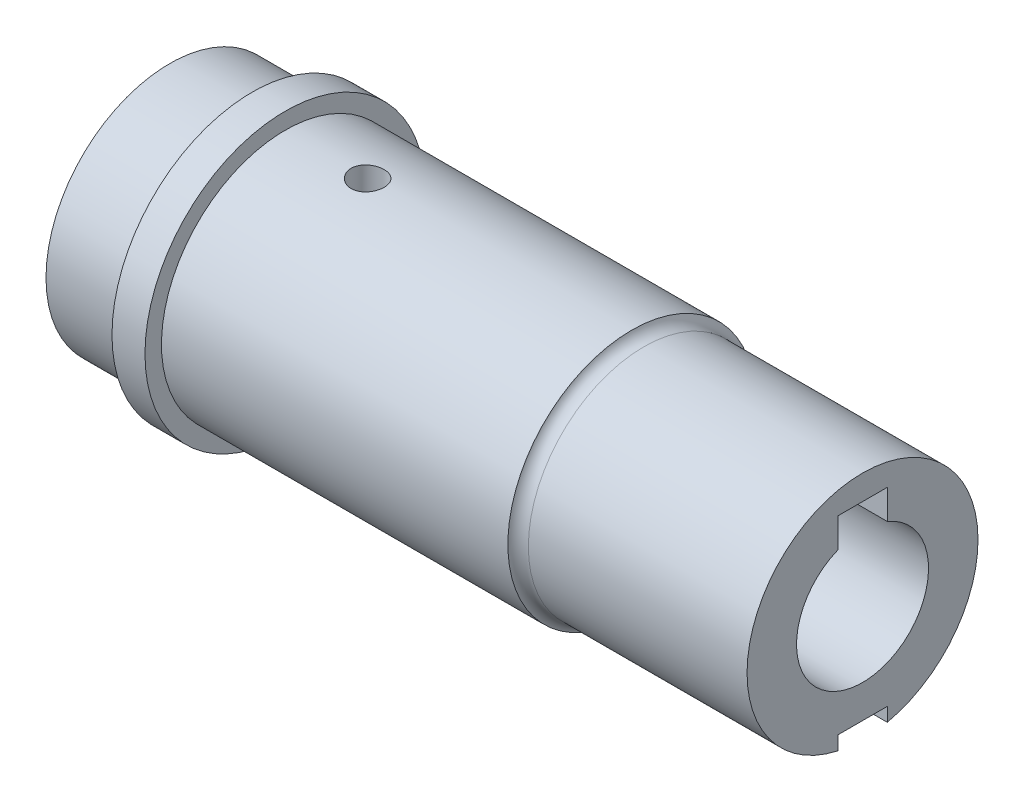
ISO-10303-21;
HEADER;
FILE_DESCRIPTION(('STEP AP214'),'2;1');
FILE_NAME('part.step','',(''),(''),'','','');
FILE_SCHEMA(('AUTOMOTIVE_DESIGN { 1 0 10303 214 1 1 1 1 }'));
ENDSEC;
DATA;
#1=APPLICATION_CONTEXT('core data for automotive mechanical design processes');
#2=APPLICATION_PROTOCOL_DEFINITION('international standard','automotive_design',2000,#1);
#3=PRODUCT_CONTEXT('',#1,'mechanical');
#4=PRODUCT('Part','Part','',(#3));
#5=PRODUCT_RELATED_PRODUCT_CATEGORY('part','',(#4));
#6=PRODUCT_DEFINITION_FORMATION('','',#4);
#7=PRODUCT_DEFINITION_CONTEXT('part definition',#1,'design');
#8=PRODUCT_DEFINITION('design','',#6,#7);
#9=PRODUCT_DEFINITION_SHAPE('','',#8);
#10=(LENGTH_UNIT() NAMED_UNIT(*) SI_UNIT(.MILLI.,.METRE.));
#11=(NAMED_UNIT(*) PLANE_ANGLE_UNIT() SI_UNIT($,.RADIAN.));
#12=(NAMED_UNIT(*) SI_UNIT($,.STERADIAN.) SOLID_ANGLE_UNIT());
#13=UNCERTAINTY_MEASURE_WITH_UNIT(LENGTH_MEASURE(1.E-05),#10,'distance_accuracy_value','');
#14=(GEOMETRIC_REPRESENTATION_CONTEXT(3) GLOBAL_UNCERTAINTY_ASSIGNED_CONTEXT((#13)) GLOBAL_UNIT_ASSIGNED_CONTEXT((#10,
#11,#12)) REPRESENTATION_CONTEXT('',''));
#15=CARTESIAN_POINT('',(0.,0.,0.));
#16=DIRECTION('',(0.,0.,1.));
#17=DIRECTION('',(1.,0.,0.));
#18=AXIS2_PLACEMENT_3D('',#15,#16,#17);
#19=CARTESIAN_POINT('',(42.,0.,0.));
#20=DIRECTION('',(-1.,0.,0.));
#21=DIRECTION('',(0.,0.,1.));
#22=AXIS2_PLACEMENT_3D('',#19,#20,#21);
#23=CYLINDRICAL_SURFACE('',#22,7.5);
#24=CARTESIAN_POINT('',(7.,0.,0.));
#25=DIRECTION('',(1.,0.,0.));
#26=DIRECTION('',(0.,0.,-1.));
#27=AXIS2_PLACEMENT_3D('',#24,#25,#26);
#28=CIRCLE('',#27,7.5);
#29=CARTESIAN_POINT('',(7.,0.,-7.5));
#30=VERTEX_POINT('',#29);
#31=EDGE_CURVE('E267',#30,#30,#28,.T.);
#32=ORIENTED_EDGE('',*,*,#31,.T.);
#33=EDGE_LOOP('',(#32));
#34=FACE_BOUND('',#33,.T.);
#35=CARTESIAN_POINT('',(12.,7.43303437365925,1.));
#36=CARTESIAN_POINT('',(12.0559019277301,7.43303522266631,0.99999764297421));
#37=CARTESIAN_POINT('',(12.1118380165464,7.43367182371829,0.995296633522847));
#38=CARTESIAN_POINT('',(12.222151231157,7.43614824351763,0.976618981332773));
#39=CARTESIAN_POINT('',(12.2765267024564,7.43798929330704,0.962632848245785));
#40=CARTESIAN_POINT('',(12.382105684117,7.44266246058434,0.925806555700512));
#41=CARTESIAN_POINT('',(12.4333114058099,7.4454938777722,0.902972651375005));
#42=CARTESIAN_POINT('',(12.5311555378537,7.45182791129731,0.849112824403647));
#43=CARTESIAN_POINT('',(12.5777946794687,7.45533041990363,0.818088216317403));
#44=CARTESIAN_POINT('',(12.6654867273345,7.46263688659337,0.74851685244753));
#45=CARTESIAN_POINT('',(12.7065064328398,7.4664424424659,0.709928411374281));
#46=CARTESIAN_POINT('',(12.7815081227281,7.47391188129393,0.626414614363067));
#47=CARTESIAN_POINT('',(12.8154897457381,7.47757575696696,0.581488933235995));
#48=CARTESIAN_POINT('',(12.8755709208582,7.48436549880109,0.486365862463802));
#49=CARTESIAN_POINT('',(12.9016402446451,7.48748928251119,0.43614921885561));
#50=CARTESIAN_POINT('',(12.9449630820904,7.49282926707925,0.332001908018684));
#51=CARTESIAN_POINT('',(12.9622169661888,7.49504550607303,0.2780713969612));
#52=CARTESIAN_POINT('',(12.9873194547901,7.49830943097799,0.168367687507043));
#53=CARTESIAN_POINT('',(12.995223407506,7.49936399102537,0.112607361734948));
#54=CARTESIAN_POINT('',(13.0015733043684,7.5002092398576,0.000542501151827599));
#55=CARTESIAN_POINT('',(13.0000196688683,7.49999998481415,-0.0557620093612336));
#56=CARTESIAN_POINT('',(12.9875426347295,7.49834672058453,-0.166940062232885));
#57=CARTESIAN_POINT('',(12.9766787676272,7.49691055668904,-0.221820418680892));
#58=CARTESIAN_POINT('',(12.9459828364892,7.49297362046144,-0.328972061356277));
#59=CARTESIAN_POINT('',(12.9261505824159,7.49047282557017,-0.38124329227092));
#60=CARTESIAN_POINT('',(12.8780182794391,7.48467409502082,-0.481875904212065));
#61=CARTESIAN_POINT('',(12.8496926884085,7.48137376072939,-0.53022492467663));
#62=CARTESIAN_POINT('',(12.7853963713586,7.4743447520952,-0.621505845367393));
#63=CARTESIAN_POINT('',(12.7494252466861,7.47061605542144,-0.664437462933408));
#64=CARTESIAN_POINT('',(12.6705260758205,7.46311294047831,-0.744015030772694));
#65=CARTESIAN_POINT('',(12.6275461159032,7.459338392122,-0.780609516765106));
#66=CARTESIAN_POINT('',(12.5360270343137,7.45219749384619,-0.846073465285956));
#67=CARTESIAN_POINT('',(12.4874878905985,7.44883114554537,-0.874942897181765));
#68=CARTESIAN_POINT('',(12.3861799998266,7.4428878816717,-0.9241414304325));
#69=CARTESIAN_POINT('',(12.3334090477408,7.44031138107393,-0.944466044533533));
#70=CARTESIAN_POINT('',(12.2251609896808,7.43624737732859,-0.97595045022462));
#71=CARTESIAN_POINT('',(12.1696840329867,7.43475981418081,-0.987110746770717));
#72=CARTESIAN_POINT('',(12.0580543324975,7.43305322505173,-0.999880803843635));
#73=CARTESIAN_POINT('',(12.0019100348337,7.43282455755814,-1.00156315549406));
#74=CARTESIAN_POINT('',(11.8901403719476,7.43363612148349,-0.995521440943979));
#75=CARTESIAN_POINT('',(11.8345149941303,7.43467632202375,-0.987797603648882));
#76=CARTESIAN_POINT('',(11.7255820067972,7.43789960218385,-0.963224025185097));
#77=CARTESIAN_POINT('',(11.6722662534909,7.44007823893825,-0.946409751616798));
#78=CARTESIAN_POINT('',(11.5692105432738,7.44532929507204,-0.904169225400625));
#79=CARTESIAN_POINT('',(11.5194707283381,7.44840174991421,-0.878742631046914));
#80=CARTESIAN_POINT('',(11.4246513447796,7.45511723309759,-0.819822032086053));
#81=CARTESIAN_POINT('',(11.3796014758159,7.45876356894567,-0.7862806158315));
#82=CARTESIAN_POINT('',(11.2957445307815,7.46620571758255,-0.712149161563993));
#83=CARTESIAN_POINT('',(11.256937731926,7.47000153699967,-0.671558810718769));
#84=CARTESIAN_POINT('',(11.1864117230394,7.47734474327666,-0.584163774179119));
#85=CARTESIAN_POINT('',(11.1547403418142,7.48089035024858,-0.537320320466262));
#86=CARTESIAN_POINT('',(11.0997158589123,7.48730670739152,-0.43893622615881));
#87=CARTESIAN_POINT('',(11.0763625701219,7.49017747274246,-0.38739569125685));
#88=CARTESIAN_POINT('',(11.0387153692059,7.49491282345577,-0.281236386261717));
#89=CARTESIAN_POINT('',(11.0243942854582,7.49678042410392,-0.226627392123681));
#90=CARTESIAN_POINT('',(11.0051297572695,7.49931158343309,-0.115753246711599));
#91=CARTESIAN_POINT('',(11.0001858286461,7.49997520428063,-0.0594881810999117));
#92=CARTESIAN_POINT('',(10.9998258663798,7.50002323624209,0.0526349368557948));
#93=CARTESIAN_POINT('',(11.0043362647028,7.49941752456714,0.108492762960941));
#94=CARTESIAN_POINT('',(11.022600520616,7.4970146660993,0.218648721526177));
#95=CARTESIAN_POINT('',(11.0363543652607,7.49521752097504,0.272946856170524));
#96=CARTESIAN_POINT('',(11.0726910235383,7.49063278321235,0.37842911729443));
#97=CARTESIAN_POINT('',(11.095269813204,7.48784564204157,0.429614650771956));
#98=CARTESIAN_POINT('',(11.1486077748229,7.48158874697992,0.527482039315438));
#99=CARTESIAN_POINT('',(11.1793670978262,7.47811898048495,0.574163811199582));
#100=CARTESIAN_POINT('',(11.2484633410018,7.47085145604927,0.662073643033369));
#101=CARTESIAN_POINT('',(11.2868548950696,7.46705145149955,0.703258578582));
#102=CARTESIAN_POINT('',(11.3700115345237,7.45956932448384,0.778629477936081));
#103=CARTESIAN_POINT('',(11.4147781219606,7.45588723005032,0.812813787651156));
#104=CARTESIAN_POINT('',(11.5096419707854,7.4490405494253,0.873343954892478));
#105=CARTESIAN_POINT('',(11.559761795755,7.44587830880396,0.89965470214564));
#106=CARTESIAN_POINT('',(11.6637242337586,7.4404568329187,0.943447591407442));
#107=CARTESIAN_POINT('',(11.7175627848798,7.43819663011144,0.960939198331794));
#108=CARTESIAN_POINT('',(11.8097241393627,7.43537566912471,0.982477401892938));
#109=CARTESIAN_POINT('',(11.8474691364837,7.4345021431111,0.989038740679089));
#110=CARTESIAN_POINT('',(11.9234707547356,7.43333120737231,0.997800826715829));
#111=CARTESIAN_POINT('',(11.9617273711999,7.43303379239608,1.00000161371131));
#112=CARTESIAN_POINT('',(12.,7.43303437365925,1.));
#113=B_SPLINE_CURVE_WITH_KNOTS('',3,(#35,#36,#37,#38,#39,#40,#41,#42,#43,#44,#45,#46,#47,#48,
#49,#50,#51,#52,#53,#54,#55,#56,#57,#58,#59,#60,#61,#62,#63,#64,#65,#66,#67,#68,#69,#70,#71,#72,
#73,#74,#75,#76,#77,#78,#79,#80,#81,#82,#83,#84,#85,#86,#87,#88,#89,#90,#91,#92,#93,#94,#95,#96,
#97,#98,#99,#100,#101,#102,#103,#104,#105,#106,#107,#108,#109,#110,#111,#112),.UNSPECIFIED.,.T.,
.F.,(4,2,2,2,2,2,2,2,2,2,2,2,2,2,2,2,2,2,2,2,2,2,2,2,2,2,2,2,2,2,2,2,2,2,2,2,2,2,4),(0.,
0.16756594461955,0.335303423041822,0.502922531373104,0.67051475416376,0.839057975594805,
1.00760984880017,1.17679778261471,1.34597860627362,1.51415284761382,1.68231961431326,
1.84941904333874,2.01652201332237,2.18413264227024,2.35175201291212,2.52067457533377,
2.68959780758443,2.85860963826768,3.02761215573449,3.19531851289863,3.36302078890669,
3.53007342408195,3.69713268808003,3.86519264070064,4.03326005374208,4.2024225588115,
4.37158125836474,4.54022861884065,4.70886727109971,4.87619854927048,5.04352959309218,
5.21078442673995,5.37804234889437,5.54654371183369,5.71508484203598,5.88436670989948,
6.05346651155517,6.16818970471025,6.28291185219902),.UNSPECIFIED.);
#114=CARTESIAN_POINT('',(12.,7.43303437365925,1.));
#115=VERTEX_POINT('',#114);
#116=EDGE_CURVE('E204',#115,#115,#113,.T.);
#117=ORIENTED_EDGE('',*,*,#116,.F.);
#118=EDGE_LOOP('',(#117));
#119=FACE_BOUND('',#118,.T.);
#120=CARTESIAN_POINT('',(28.,0.,0.));
#121=DIRECTION('',(1.,0.,0.));
#122=DIRECTION('',(0.,0.,-1.));
#123=AXIS2_PLACEMENT_3D('',#120,#121,#122);
#124=CIRCLE('',#123,7.5);
#125=CARTESIAN_POINT('',(28.,-7.34846922834954,-1.5));
#126=VERTEX_POINT('',#125);
#127=CARTESIAN_POINT('',(28.,-7.34846922834954,1.5));
#128=VERTEX_POINT('',#127);
#129=EDGE_CURVE('E164',#126,#128,#124,.T.);
#130=ORIENTED_EDGE('',*,*,#129,.F.);
#131=DIRECTION('',(-1.,0.,0.));
#132=VECTOR('',#131,1.);
#133=CARTESIAN_POINT('',(42.,-7.34846922834953,-1.5));
#134=LINE('',#133,#132);
#135=CARTESIAN_POINT('',(9.,-7.34846922834953,-1.5));
#136=VERTEX_POINT('',#135);
#137=EDGE_CURVE('E201',#126,#136,#134,.T.);
#138=ORIENTED_EDGE('',*,*,#137,.T.);
#139=CARTESIAN_POINT('',(9.,0.,0.));
#140=DIRECTION('',(-1.,0.,0.));
#141=DIRECTION('',(0.,0.,1.));
#142=AXIS2_PLACEMENT_3D('',#139,#140,#141);
#143=CIRCLE('',#142,7.5);
#144=CARTESIAN_POINT('',(9.,-7.34846922834953,1.5));
#145=VERTEX_POINT('',#144);
#146=EDGE_CURVE('E277',#136,#145,#143,.T.);
#147=ORIENTED_EDGE('',*,*,#146,.T.);
#148=DIRECTION('',(-1.,0.,0.));
#149=VECTOR('',#148,1.);
#150=CARTESIAN_POINT('',(42.,-7.34846922834953,1.5));
#151=LINE('',#150,#149);
#152=EDGE_CURVE('E194',#145,#128,#151,.F.);
#153=ORIENTED_EDGE('',*,*,#152,.T.);
#154=EDGE_LOOP('',(#130,#138,#147,#153));
#155=FACE_BOUND('',#154,.T.);
#156=ADVANCED_FACE('F38',(#34,#119,#155),#23,.T.);
#157=CARTESIAN_POINT('',(42.,0.,0.));
#158=DIRECTION('',(1.,0.,0.));
#159=DIRECTION('',(0.,0.,-1.));
#160=AXIS2_PLACEMENT_3D('',#157,#158,#159);
#161=PLANE('',#160);
#162=DIRECTION('',(0.,1.,0.));
#163=VECTOR('',#162,1.);
#164=CARTESIAN_POINT('',(42.,2.5,1.5));
#165=LINE('',#164,#163);
#166=CARTESIAN_POINT('',(42.,3.70809924354783,1.5));
#167=VERTEX_POINT('',#166);
#168=CARTESIAN_POINT('',(42.,5.5,1.5));
#169=VERTEX_POINT('',#168);
#170=EDGE_CURVE('E121',#167,#169,#165,.T.);
#171=ORIENTED_EDGE('',*,*,#170,.T.);
#172=DIRECTION('',(0.,0.,-1.));
#173=VECTOR('',#172,1.);
#174=CARTESIAN_POINT('',(42.,5.5,-1.5));
#175=LINE('',#174,#173);
#176=CARTESIAN_POINT('',(42.,5.5,-1.5));
#177=VERTEX_POINT('',#176);
#178=EDGE_CURVE('E132',#169,#177,#175,.T.);
#179=ORIENTED_EDGE('',*,*,#178,.T.);
#180=DIRECTION('',(0.,-1.,0.));
#181=VECTOR('',#180,1.);
#182=CARTESIAN_POINT('',(42.,2.5,-1.5));
#183=LINE('',#182,#181);
#184=CARTESIAN_POINT('',(42.,3.70809924354783,-1.5));
#185=VERTEX_POINT('',#184);
#186=EDGE_CURVE('E129',#177,#185,#183,.T.);
#187=ORIENTED_EDGE('',*,*,#186,.T.);
#188=CARTESIAN_POINT('',(42.,0.,0.));
#189=DIRECTION('',(-1.,0.,0.));
#190=DIRECTION('',(0.,0.,1.));
#191=AXIS2_PLACEMENT_3D('',#188,#189,#190);
#192=CIRCLE('',#191,4.);
#193=EDGE_CURVE('E144',#185,#167,#192,.T.);
#194=ORIENTED_EDGE('',*,*,#193,.T.);
#195=EDGE_LOOP('',(#171,#179,#187,#194));
#196=FACE_BOUND('',#195,.T.);
#197=DIRECTION('',(0.,1.,0.));
#198=VECTOR('',#197,1.);
#199=CARTESIAN_POINT('',(42.,0.,-1.5));
#200=LINE('',#199,#198);
#201=CARTESIAN_POINT('',(42.,-6.83739716558867,-1.5));
#202=VERTEX_POINT('',#201);
#203=CARTESIAN_POINT('',(42.,-6.,-1.5));
#204=VERTEX_POINT('',#203);
#205=EDGE_CURVE('E274',#202,#204,#200,.T.);
#206=ORIENTED_EDGE('',*,*,#205,.F.);
#207=CARTESIAN_POINT('',(42.,0.,0.));
#208=DIRECTION('',(1.,0.,0.));
#209=DIRECTION('',(0.,0.,-1.));
#210=AXIS2_PLACEMENT_3D('',#207,#208,#209);
#211=CIRCLE('',#210,7.);
#212=CARTESIAN_POINT('',(42.,-6.83739716558867,1.5));
#213=VERTEX_POINT('',#212);
#214=EDGE_CURVE('E160',#202,#213,#211,.T.);
#215=ORIENTED_EDGE('',*,*,#214,.T.);
#216=DIRECTION('',(0.,-1.,0.));
#217=VECTOR('',#216,1.);
#218=CARTESIAN_POINT('',(42.,-9.,1.5));
#219=LINE('',#218,#217);
#220=CARTESIAN_POINT('',(42.,-6.,1.5));
#221=VERTEX_POINT('',#220);
#222=EDGE_CURVE('E176',#221,#213,#219,.T.);
#223=ORIENTED_EDGE('',*,*,#222,.F.);
#224=DIRECTION('',(0.,0.,1.));
#225=VECTOR('',#224,1.);
#226=CARTESIAN_POINT('',(42.,-6.,1.5));
#227=LINE('',#226,#225);
#228=EDGE_CURVE('E171',#204,#221,#227,.T.);
#229=ORIENTED_EDGE('',*,*,#228,.F.);
#230=EDGE_LOOP('',(#206,#215,#223,#229));
#231=FACE_BOUND('',#230,.T.);
#232=ADVANCED_FACE('F141',(#196,#231),#161,.T.);
#233=CARTESIAN_POINT('',(9.,-9.,-1.5));
#234=DIRECTION('',(0.,0.,-1.));
#235=DIRECTION('',(-1.,0.,0.));
#236=AXIS2_PLACEMENT_3D('',#233,#234,#235);
#237=PLANE('',#236);
#238=ORIENTED_EDGE('',*,*,#137,.F.);
#239=CARTESIAN_POINT('',(28.,-7.34846922834954,-1.5));
#240=CARTESIAN_POINT('',(28.0168950700723,-7.30574522994381,-1.5));
#241=CARTESIAN_POINT('',(28.0374125277603,-7.26445548410346,-1.5));
#242=CARTESIAN_POINT('',(28.0850285427057,-7.1858553623962,-1.5));
#243=CARTESIAN_POINT('',(28.1121280437387,-7.148545558304,-1.5));
#244=CARTESIAN_POINT('',(28.1722638733595,-7.07900059645885,-1.5));
#245=CARTESIAN_POINT('',(28.2053050497103,-7.04676962307335,-1.5));
#246=CARTESIAN_POINT('',(28.2763963107745,-6.98842220432071,-1.5));
#247=CARTESIAN_POINT('',(28.3144448834475,-6.96230391974588,-1.5));
#248=CARTESIAN_POINT('',(28.3938862557374,-6.91735378610503,-1.5));
#249=CARTESIAN_POINT('',(28.4352218808913,-6.89842077372386,-1.5));
#250=CARTESIAN_POINT('',(28.5205199865747,-6.86794198457983,-1.5));
#251=CARTESIAN_POINT('',(28.5644800452907,-6.85638950888004,-1.5));
#252=CARTESIAN_POINT('',(28.6309672571116,-6.84494921536756,-1.5));
#253=CARTESIAN_POINT('',(28.6530237918767,-6.84211707745697,-1.5));
#254=CARTESIAN_POINT('',(28.6972566244864,-6.83834280350903,-1.5));
#255=CARTESIAN_POINT('',(28.7194326230907,-6.83739716024502,-1.5));
#256=CARTESIAN_POINT('',(28.7416198487096,-6.83739716558862,-1.5));
#257=B_SPLINE_CURVE_WITH_KNOTS('',3,(#239,#240,#241,#242,#243,#244,#245,#246,#247,#248,#249,
#250,#251,#252,#253,#254,#255,#256),.UNSPECIFIED.,.F.,.F.,(4,2,2,2,2,2,2,2,4),(0.,
0.137671144862208,0.275362041562459,0.413165793063797,0.550928028220039,0.686671569053909,
0.822291726693864,0.888935054734805,0.955454368698406),.UNSPECIFIED.);
#258=CARTESIAN_POINT('',(28.7416198487096,-6.83739716558867,-1.5));
#259=VERTEX_POINT('',#258);
#260=EDGE_CURVE('E293',#126,#259,#257,.T.);
#261=ORIENTED_EDGE('',*,*,#260,.T.);
#262=DIRECTION('',(1.,0.,0.));
#263=VECTOR('',#262,1.);
#264=CARTESIAN_POINT('',(28.,-6.83739716558867,-1.5));
#265=LINE('',#264,#263);
#266=EDGE_CURVE('E167',#202,#259,#265,.F.);
#267=ORIENTED_EDGE('',*,*,#266,.F.);
#268=ORIENTED_EDGE('',*,*,#205,.T.);
#269=DIRECTION('',(1.,0.,0.));
#270=VECTOR('',#269,1.);
#271=CARTESIAN_POINT('',(9.,-6.,-1.5));
#272=LINE('',#271,#270);
#273=CARTESIAN_POINT('',(9.,-6.,-1.5));
#274=VERTEX_POINT('',#273);
#275=EDGE_CURVE('E184',#274,#204,#272,.T.);
#276=ORIENTED_EDGE('',*,*,#275,.F.);
#277=DIRECTION('',(0.,1.,0.));
#278=VECTOR('',#277,1.);
#279=CARTESIAN_POINT('',(9.,-9.,-1.5));
#280=LINE('',#279,#278);
#281=EDGE_CURVE('E172',#136,#274,#280,.T.);
#282=ORIENTED_EDGE('',*,*,#281,.F.);
#283=EDGE_LOOP('',(#238,#261,#267,#268,#276,#282));
#284=FACE_BOUND('',#283,.T.);
#285=ADVANCED_FACE('F227',(#284),#237,.F.);
#286=CARTESIAN_POINT('',(9.,-9.,1.5));
#287=DIRECTION('',(0.,0.,1.));
#288=DIRECTION('',(1.,0.,0.));
#289=AXIS2_PLACEMENT_3D('',#286,#287,#288);
#290=PLANE('',#289);
#291=DIRECTION('',(1.,0.,0.));
#292=VECTOR('',#291,1.);
#293=CARTESIAN_POINT('',(28.,-6.83739716558867,1.5));
#294=LINE('',#293,#292);
#295=CARTESIAN_POINT('',(28.7416198487096,-6.83739716558867,1.5));
#296=VERTEX_POINT('',#295);
#297=EDGE_CURVE('E281',#296,#213,#294,.T.);
#298=ORIENTED_EDGE('',*,*,#297,.F.);
#299=CARTESIAN_POINT('',(28.7416198487096,-6.83739716558867,1.5));
#300=CARTESIAN_POINT('',(28.6973445151761,-6.83735408309103,1.5));
#301=CARTESIAN_POINT('',(28.6530873524814,-6.84115737824617,1.5));
#302=CARTESIAN_POINT('',(28.5658994944407,-6.85613124019664,1.5));
#303=CARTESIAN_POINT('',(28.5229669991804,-6.86729130356146,1.5));
#304=CARTESIAN_POINT('',(28.4395787344695,-6.89665727140991,1.5));
#305=CARTESIAN_POINT('',(28.3991233657509,-6.91486431243417,1.5));
#306=CARTESIAN_POINT('',(28.3217948790736,-6.95773992335086,1.5));
#307=CARTESIAN_POINT('',(28.2849221424386,-6.98240918003008,1.5));
#308=CARTESIAN_POINT('',(28.215352521877,-7.03776699515677,1.5));
#309=CARTESIAN_POINT('',(28.1827061159385,-7.068518870983,1.5));
#310=CARTESIAN_POINT('',(28.1229133298351,-7.1349658843502,1.5));
#311=CARTESIAN_POINT('',(28.0957648811544,-7.17065915423195,1.5));
#312=CARTESIAN_POINT('',(28.0575401339722,-7.23046615720088,1.5));
#313=CARTESIAN_POINT('',(28.0444423137942,-7.25331489200286,1.5));
#314=CARTESIAN_POINT('',(28.0205125481647,-7.30010993810262,1.5));
#315=CARTESIAN_POINT('',(28.0096759584208,-7.32405387409207,1.5));
#316=CARTESIAN_POINT('',(27.9999999999997,-7.34846922834936,1.5));
#317=B_SPLINE_CURVE_WITH_KNOTS('',3,(#299,#300,#301,#302,#303,#304,#305,#306,#307,#308,#309,
#310,#311,#312,#313,#314,#315,#316),.UNSPECIFIED.,.F.,.F.,(4,2,2,2,2,2,2,2,4),(0.,
0.132635678387283,0.265082398655115,0.397550488913641,0.530032663237874,0.663974319754674,
0.797865488928896,0.876766272163503,0.955503372070595),.UNSPECIFIED.);
#318=EDGE_CURVE('E63',#296,#128,#317,.T.);
#319=ORIENTED_EDGE('',*,*,#318,.T.);
#320=ORIENTED_EDGE('',*,*,#152,.F.);
#321=DIRECTION('',(0.,-1.,0.));
#322=VECTOR('',#321,1.);
#323=CARTESIAN_POINT('',(9.,-9.,1.5));
#324=LINE('',#323,#322);
#325=CARTESIAN_POINT('',(9.,-6.,1.5));
#326=VERTEX_POINT('',#325);
#327=EDGE_CURVE('E180',#326,#145,#324,.T.);
#328=ORIENTED_EDGE('',*,*,#327,.F.);
#329=DIRECTION('',(1.,0.,0.));
#330=VECTOR('',#329,1.);
#331=CARTESIAN_POINT('',(9.,-6.,1.5));
#332=LINE('',#331,#330);
#333=EDGE_CURVE('E191',#326,#221,#332,.T.);
#334=ORIENTED_EDGE('',*,*,#333,.T.);
#335=ORIENTED_EDGE('',*,*,#222,.T.);
#336=EDGE_LOOP('',(#298,#319,#320,#328,#334,#335));
#337=FACE_BOUND('',#336,.T.);
#338=ADVANCED_FACE('F247',(#337),#290,.F.);
#339=CARTESIAN_POINT('',(5.,0.,0.));
#340=DIRECTION('',(-1.,0.,0.));
#341=DIRECTION('',(0.,0.,1.));
#342=AXIS2_PLACEMENT_3D('',#339,#340,#341);
#343=CYLINDRICAL_SURFACE('',#342,7.5);
#344=CARTESIAN_POINT('',(5.,0.,0.));
#345=DIRECTION('',(1.,0.,0.));
#346=DIRECTION('',(0.,0.,-1.));
#347=AXIS2_PLACEMENT_3D('',#344,#345,#346);
#348=CIRCLE('',#347,7.5);
#349=CARTESIAN_POINT('',(5.,0.,-7.5));
#350=VERTEX_POINT('',#349);
#351=EDGE_CURVE('E257',#350,#350,#348,.T.);
#352=ORIENTED_EDGE('',*,*,#351,.F.);
#353=EDGE_LOOP('',(#352));
#354=FACE_BOUND('',#353,.T.);
#355=CARTESIAN_POINT('',(0.,0.,0.));
#356=DIRECTION('',(1.,0.,0.));
#357=DIRECTION('',(0.,0.,-1.));
#358=AXIS2_PLACEMENT_3D('',#355,#356,#357);
#359=CIRCLE('',#358,7.5);
#360=CARTESIAN_POINT('',(0.,0.,-7.5));
#361=VERTEX_POINT('',#360);
#362=EDGE_CURVE('E260',#361,#361,#359,.T.);
#363=ORIENTED_EDGE('',*,*,#362,.T.);
#364=EDGE_LOOP('',(#363));
#365=FACE_BOUND('',#364,.T.);
#366=ADVANCED_FACE('F244',(#354,#365),#343,.T.);
#367=CARTESIAN_POINT('',(0.,0.,0.));
#368=DIRECTION('',(1.,0.,0.));
#369=DIRECTION('',(0.,0.,-1.));
#370=AXIS2_PLACEMENT_3D('',#367,#368,#369);
#371=PLANE('',#370);
#372=DIRECTION('',(0.,0.,-1.));
#373=VECTOR('',#372,1.);
#374=CARTESIAN_POINT('',(0.,5.5,-1.5));
#375=LINE('',#374,#373);
#376=CARTESIAN_POINT('',(0.,5.5,1.5));
#377=VERTEX_POINT('',#376);
#378=CARTESIAN_POINT('',(0.,5.5,-1.5));
#379=VERTEX_POINT('',#378);
#380=EDGE_CURVE('E148',#377,#379,#375,.T.);
#381=ORIENTED_EDGE('',*,*,#380,.F.);
#382=DIRECTION('',(0.,1.,0.));
#383=VECTOR('',#382,1.);
#384=CARTESIAN_POINT('',(0.,2.5,1.5));
#385=LINE('',#384,#383);
#386=CARTESIAN_POINT('',(0.,3.70809924354783,1.5));
#387=VERTEX_POINT('',#386);
#388=EDGE_CURVE('E123',#387,#377,#385,.T.);
#389=ORIENTED_EDGE('',*,*,#388,.F.);
#390=CARTESIAN_POINT('',(0.,0.,0.));
#391=DIRECTION('',(-1.,0.,0.));
#392=DIRECTION('',(0.,0.,1.));
#393=AXIS2_PLACEMENT_3D('',#390,#391,#392);
#394=CIRCLE('',#393,4.);
#395=CARTESIAN_POINT('',(0.,3.70809924354783,-1.5));
#396=VERTEX_POINT('',#395);
#397=EDGE_CURVE('E213',#396,#387,#394,.T.);
#398=ORIENTED_EDGE('',*,*,#397,.F.);
#399=DIRECTION('',(0.,-1.,0.));
#400=VECTOR('',#399,1.);
#401=CARTESIAN_POINT('',(0.,2.5,-1.5));
#402=LINE('',#401,#400);
#403=EDGE_CURVE('E55',#379,#396,#402,.T.);
#404=ORIENTED_EDGE('',*,*,#403,.F.);
#405=EDGE_LOOP('',(#381,#389,#398,#404));
#406=FACE_BOUND('',#405,.T.);
#407=ORIENTED_EDGE('',*,*,#362,.F.);
#408=EDGE_LOOP('',(#407));
#409=FACE_BOUND('',#408,.T.);
#410=ADVANCED_FACE('F241',(#406,#409),#371,.F.);
#411=CARTESIAN_POINT('',(7.,0.,0.));
#412=DIRECTION('',(-1.,0.,0.));
#413=DIRECTION('',(0.,0.,1.));
#414=AXIS2_PLACEMENT_3D('',#411,#412,#413);
#415=CYLINDRICAL_SURFACE('',#414,8.5);
#416=CARTESIAN_POINT('',(7.,0.,0.));
#417=DIRECTION('',(1.,0.,0.));
#418=DIRECTION('',(0.,0.,-1.));
#419=AXIS2_PLACEMENT_3D('',#416,#417,#418);
#420=CIRCLE('',#419,8.5);
#421=CARTESIAN_POINT('',(7.,0.,-8.5));
#422=VERTEX_POINT('',#421);
#423=EDGE_CURVE('E263',#422,#422,#420,.T.);
#424=ORIENTED_EDGE('',*,*,#423,.F.);
#425=EDGE_LOOP('',(#424));
#426=FACE_BOUND('',#425,.T.);
#427=CARTESIAN_POINT('',(5.,0.,0.));
#428=DIRECTION('',(1.,0.,0.));
#429=DIRECTION('',(0.,0.,-1.));
#430=AXIS2_PLACEMENT_3D('',#427,#428,#429);
#431=CIRCLE('',#430,8.5);
#432=CARTESIAN_POINT('',(5.,0.,-8.5));
#433=VERTEX_POINT('',#432);
#434=EDGE_CURVE('E270',#433,#433,#431,.T.);
#435=ORIENTED_EDGE('',*,*,#434,.T.);
#436=EDGE_LOOP('',(#435));
#437=FACE_BOUND('',#436,.T.);
#438=ADVANCED_FACE('F234',(#426,#437),#415,.T.);
#439=CARTESIAN_POINT('',(7.,0.,0.));
#440=DIRECTION('',(1.,0.,0.));
#441=DIRECTION('',(0.,0.,-1.));
#442=AXIS2_PLACEMENT_3D('',#439,#440,#441);
#443=PLANE('',#442);
#444=ORIENTED_EDGE('',*,*,#31,.F.);
#445=EDGE_LOOP('',(#444));
#446=FACE_BOUND('',#445,.T.);
#447=ORIENTED_EDGE('',*,*,#423,.T.);
#448=EDGE_LOOP('',(#447));
#449=FACE_BOUND('',#448,.T.);
#450=ADVANCED_FACE('F231',(#446,#449),#443,.T.);
#451=CARTESIAN_POINT('',(5.,0.,0.));
#452=DIRECTION('',(1.,0.,0.));
#453=DIRECTION('',(0.,0.,-1.));
#454=AXIS2_PLACEMENT_3D('',#451,#452,#453);
#455=PLANE('',#454);
#456=ORIENTED_EDGE('',*,*,#351,.T.);
#457=EDGE_LOOP('',(#456));
#458=FACE_BOUND('',#457,.T.);
#459=ORIENTED_EDGE('',*,*,#434,.F.);
#460=EDGE_LOOP('',(#459));
#461=FACE_BOUND('',#460,.T.);
#462=ADVANCED_FACE('F223',(#458,#461),#455,.F.);
#463=CARTESIAN_POINT('',(42.,0.,0.));
#464=DIRECTION('',(-1.,0.,0.));
#465=DIRECTION('',(0.,0.,1.));
#466=AXIS2_PLACEMENT_3D('',#463,#464,#465);
#467=CYLINDRICAL_SURFACE('',#466,4.);
#468=ORIENTED_EDGE('',*,*,#397,.T.);
#469=DIRECTION('',(-1.,0.,0.));
#470=VECTOR('',#469,1.);
#471=CARTESIAN_POINT('',(42.,3.70809924354783,1.5));
#472=LINE('',#471,#470);
#473=EDGE_CURVE('E11',#387,#167,#472,.F.);
#474=ORIENTED_EDGE('',*,*,#473,.T.);
#475=ORIENTED_EDGE('',*,*,#193,.F.);
#476=DIRECTION('',(-1.,0.,0.));
#477=VECTOR('',#476,1.);
#478=CARTESIAN_POINT('',(42.,3.70809924354783,-1.5));
#479=LINE('',#478,#477);
#480=EDGE_CURVE('E48',#185,#396,#479,.T.);
#481=ORIENTED_EDGE('',*,*,#480,.T.);
#482=EDGE_LOOP('',(#468,#474,#475,#481));
#483=FACE_BOUND('',#482,.T.);
#484=ADVANCED_FACE('F220',(#483),#467,.F.);
#485=CARTESIAN_POINT('',(12.,-8.501,0.));
#486=DIRECTION('',(0.,1.,0.));
#487=DIRECTION('',(0.,0.,1.));
#488=AXIS2_PLACEMENT_3D('',#485,#486,#487);
#489=CYLINDRICAL_SURFACE('',#488,1.);
#490=CARTESIAN_POINT('',(12.,5.5,0.));
#491=DIRECTION('',(0.,1.,0.));
#492=DIRECTION('',(0.,0.,1.));
#493=AXIS2_PLACEMENT_3D('',#490,#491,#492);
#494=CIRCLE('',#493,1.);
#495=CARTESIAN_POINT('',(12.,5.5,1.));
#496=VERTEX_POINT('',#495);
#497=EDGE_CURVE('E158',#496,#496,#494,.F.);
#498=ORIENTED_EDGE('',*,*,#497,.T.);
#499=EDGE_LOOP('',(#498));
#500=FACE_BOUND('',#499,.T.);
#501=ORIENTED_EDGE('',*,*,#116,.T.);
#502=EDGE_LOOP('',(#501));
#503=FACE_BOUND('',#502,.T.);
#504=ADVANCED_FACE('F215',(#500,#503),#489,.F.);
#505=CARTESIAN_POINT('',(9.,0.,0.));
#506=DIRECTION('',(-1.,0.,0.));
#507=DIRECTION('',(0.,0.,1.));
#508=AXIS2_PLACEMENT_3D('',#505,#506,#507);
#509=PLANE('',#508);
#510=ORIENTED_EDGE('',*,*,#281,.T.);
#511=DIRECTION('',(0.,0.,1.));
#512=VECTOR('',#511,1.);
#513=CARTESIAN_POINT('',(9.,-6.,1.5));
#514=LINE('',#513,#512);
#515=EDGE_CURVE('E175',#274,#326,#514,.T.);
#516=ORIENTED_EDGE('',*,*,#515,.T.);
#517=ORIENTED_EDGE('',*,*,#327,.T.);
#518=ORIENTED_EDGE('',*,*,#146,.F.);
#519=EDGE_LOOP('',(#510,#516,#517,#518));
#520=FACE_BOUND('',#519,.T.);
#521=ADVANCED_FACE('F302',(#520),#509,.F.);
#522=CARTESIAN_POINT('',(9.,-6.,1.5));
#523=DIRECTION('',(0.,1.,0.));
#524=DIRECTION('',(0.,0.,1.));
#525=AXIS2_PLACEMENT_3D('',#522,#523,#524);
#526=PLANE('',#525);
#527=ORIENTED_EDGE('',*,*,#228,.T.);
#528=ORIENTED_EDGE('',*,*,#333,.F.);
#529=ORIENTED_EDGE('',*,*,#515,.F.);
#530=ORIENTED_EDGE('',*,*,#275,.T.);
#531=EDGE_LOOP('',(#527,#528,#529,#530));
#532=FACE_BOUND('',#531,.T.);
#533=ADVANCED_FACE('F304',(#532),#526,.F.);
#534=CARTESIAN_POINT('',(28.,0.,0.));
#535=DIRECTION('',(1.,0.,0.));
#536=DIRECTION('',(0.,0.,-1.));
#537=AXIS2_PLACEMENT_3D('',#534,#535,#536);
#538=CYLINDRICAL_SURFACE('',#537,7.);
#539=ORIENTED_EDGE('',*,*,#266,.T.);
#540=CARTESIAN_POINT('',(28.7416198487096,0.,0.));
#541=DIRECTION('',(-1.,0.,0.));
#542=DIRECTION('',(0.,0.,1.));
#543=AXIS2_PLACEMENT_3D('',#540,#541,#542);
#544=CIRCLE('',#543,7.);
#545=EDGE_CURVE('E284',#259,#296,#544,.F.);
#546=ORIENTED_EDGE('',*,*,#545,.T.);
#547=ORIENTED_EDGE('',*,*,#297,.T.);
#548=ORIENTED_EDGE('',*,*,#214,.F.);
#549=EDGE_LOOP('',(#539,#546,#547,#548));
#550=FACE_BOUND('',#549,.T.);
#551=ADVANCED_FACE('F306',(#550),#538,.T.);
#552=CARTESIAN_POINT('',(28.7416198487096,0.,0.));
#553=DIRECTION('',(-1.,0.,0.));
#554=DIRECTION('',(0.,0.,1.));
#555=AXIS2_PLACEMENT_3D('',#552,#553,#554);
#556=TOROIDAL_SURFACE('',#555,7.8,0.8);
#557=ORIENTED_EDGE('',*,*,#260,.F.);
#558=ORIENTED_EDGE('',*,*,#129,.T.);
#559=ORIENTED_EDGE('',*,*,#318,.F.);
#560=ORIENTED_EDGE('',*,*,#545,.F.);
#561=EDGE_LOOP('',(#557,#558,#559,#560));
#562=FACE_BOUND('',#561,.T.);
#563=ADVANCED_FACE('F40',(#562),#556,.F.);
#564=CARTESIAN_POINT('',(42.,2.5,1.5));
#565=DIRECTION('',(0.,0.,1.));
#566=DIRECTION('',(1.,0.,0.));
#567=AXIS2_PLACEMENT_3D('',#564,#565,#566);
#568=PLANE('',#567);
#569=ORIENTED_EDGE('',*,*,#388,.T.);
#570=DIRECTION('',(-1.,0.,0.));
#571=VECTOR('',#570,1.);
#572=CARTESIAN_POINT('',(42.,5.5,1.5));
#573=LINE('',#572,#571);
#574=EDGE_CURVE('E117',#169,#377,#573,.T.);
#575=ORIENTED_EDGE('',*,*,#574,.F.);
#576=ORIENTED_EDGE('',*,*,#170,.F.);
#577=ORIENTED_EDGE('',*,*,#473,.F.);
#578=EDGE_LOOP('',(#569,#575,#576,#577));
#579=FACE_BOUND('',#578,.T.);
#580=ADVANCED_FACE('F119',(#579),#568,.F.);
#581=CARTESIAN_POINT('',(42.,2.5,-1.5));
#582=DIRECTION('',(0.,0.,-1.));
#583=DIRECTION('',(-1.,0.,0.));
#584=AXIS2_PLACEMENT_3D('',#581,#582,#583);
#585=PLANE('',#584);
#586=ORIENTED_EDGE('',*,*,#186,.F.);
#587=DIRECTION('',(-1.,0.,0.));
#588=VECTOR('',#587,1.);
#589=CARTESIAN_POINT('',(42.,5.5,-1.5));
#590=LINE('',#589,#588);
#591=EDGE_CURVE('E128',#177,#379,#590,.T.);
#592=ORIENTED_EDGE('',*,*,#591,.T.);
#593=ORIENTED_EDGE('',*,*,#403,.T.);
#594=ORIENTED_EDGE('',*,*,#480,.F.);
#595=EDGE_LOOP('',(#586,#592,#593,#594));
#596=FACE_BOUND('',#595,.T.);
#597=ADVANCED_FACE('F330',(#596),#585,.F.);
#598=CARTESIAN_POINT('',(42.,5.5,-1.5));
#599=DIRECTION('',(0.,1.,0.));
#600=DIRECTION('',(0.,0.,1.));
#601=AXIS2_PLACEMENT_3D('',#598,#599,#600);
#602=PLANE('',#601);
#603=ORIENTED_EDGE('',*,*,#380,.T.);
#604=ORIENTED_EDGE('',*,*,#591,.F.);
#605=ORIENTED_EDGE('',*,*,#178,.F.);
#606=ORIENTED_EDGE('',*,*,#574,.T.);
#607=EDGE_LOOP('',(#603,#604,#605,#606));
#608=FACE_BOUND('',#607,.T.);
#609=ORIENTED_EDGE('',*,*,#497,.F.);
#610=EDGE_LOOP('',(#609));
#611=FACE_BOUND('',#610,.T.);
#612=ADVANCED_FACE('F133',(#608,#611),#602,.F.);
#613=CLOSED_SHELL('',(#156,#232,#285,#338,#366,#410,#438,#450,#462,#484,#504,#521,#533,#551,
#563,#580,#597,#612));
#614=MANIFOLD_SOLID_BREP('B2',#613);
#615=ADVANCED_BREP_SHAPE_REPRESENTATION('',(#18,#614),#14);
#616=SHAPE_DEFINITION_REPRESENTATION(#9,#615);
ENDSEC;
END-ISO-10303-21;
